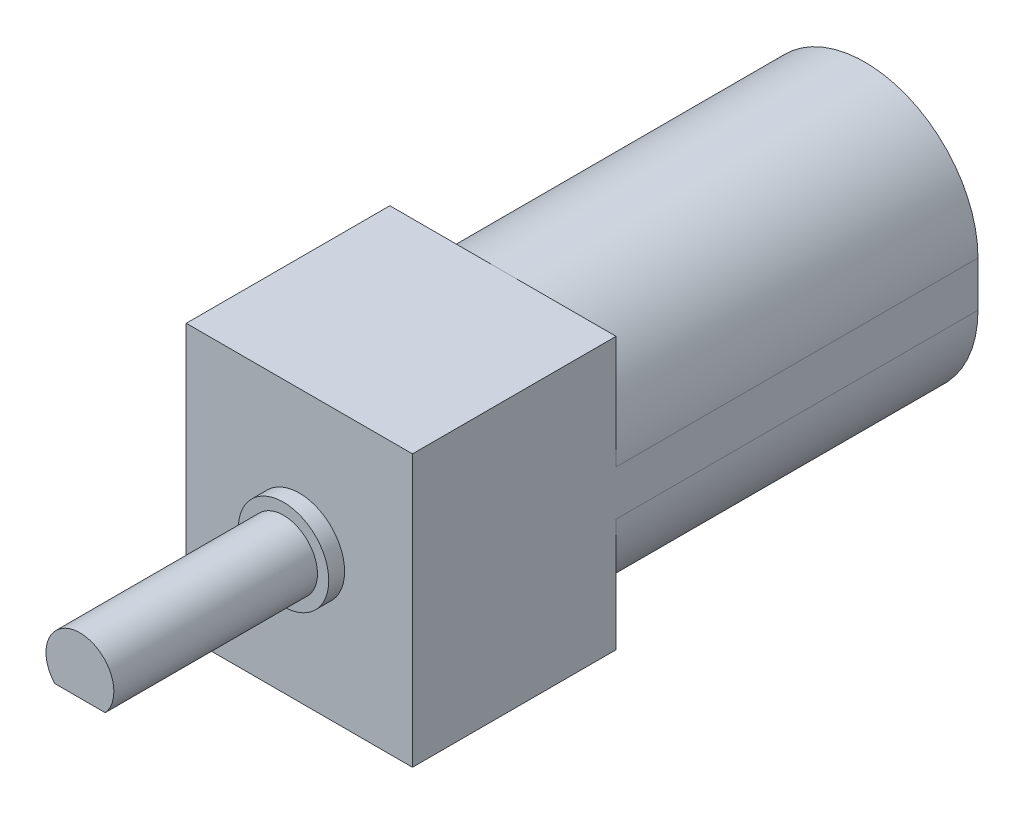
ISO-10303-21;
HEADER;
FILE_DESCRIPTION(('STEP AP214'),'2;1');
FILE_NAME('part.step','',(''),(''),'','','');
FILE_SCHEMA(('AUTOMOTIVE_DESIGN { 1 0 10303 214 1 1 1 1 }'));
ENDSEC;
DATA;
#1=APPLICATION_CONTEXT('core data for automotive mechanical design processes');
#2=APPLICATION_PROTOCOL_DEFINITION('international standard','automotive_design',2000,#1);
#3=PRODUCT_CONTEXT('',#1,'mechanical');
#4=PRODUCT('Part','Part','',(#3));
#5=PRODUCT_RELATED_PRODUCT_CATEGORY('part','',(#4));
#6=PRODUCT_DEFINITION_FORMATION('','',#4);
#7=PRODUCT_DEFINITION_CONTEXT('part definition',#1,'design');
#8=PRODUCT_DEFINITION('design','',#6,#7);
#9=PRODUCT_DEFINITION_SHAPE('','',#8);
#10=(LENGTH_UNIT() NAMED_UNIT(*) SI_UNIT(.MILLI.,.METRE.));
#11=(NAMED_UNIT(*) PLANE_ANGLE_UNIT() SI_UNIT($,.RADIAN.));
#12=(NAMED_UNIT(*) SI_UNIT($,.STERADIAN.) SOLID_ANGLE_UNIT());
#13=UNCERTAINTY_MEASURE_WITH_UNIT(LENGTH_MEASURE(1.E-05),#10,'distance_accuracy_value','');
#14=(GEOMETRIC_REPRESENTATION_CONTEXT(3) GLOBAL_UNCERTAINTY_ASSIGNED_CONTEXT((#13)) GLOBAL_UNIT_ASSIGNED_CONTEXT((#10,
#11,#12)) REPRESENTATION_CONTEXT('',''));
#15=CARTESIAN_POINT('',(0.,0.,0.));
#16=DIRECTION('',(0.,0.,1.));
#17=DIRECTION('',(1.,0.,0.));
#18=AXIS2_PLACEMENT_3D('',#15,#16,#17);
#19=CARTESIAN_POINT('',(0.,-0.999999999999999,16.));
#20=DIRECTION('',(0.,0.,-1.));
#21=DIRECTION('',(-1.,0.,0.));
#22=AXIS2_PLACEMENT_3D('',#19,#20,#21);
#23=CYLINDRICAL_SURFACE('',#22,5.);
#24=CARTESIAN_POINT('',(0.,-0.999999999999999,0.));
#25=DIRECTION('',(0.,0.,1.));
#26=DIRECTION('',(1.,0.,0.));
#27=AXIS2_PLACEMENT_3D('',#24,#25,#26);
#28=CIRCLE('',#27,5.);
#29=CARTESIAN_POINT('',(-5.,-0.999999999999999,0.));
#30=VERTEX_POINT('',#29);
#31=CARTESIAN_POINT('',(5.,-0.999999999999999,0.));
#32=VERTEX_POINT('',#31);
#33=EDGE_CURVE('E265',#30,#32,#28,.T.);
#34=ORIENTED_EDGE('',*,*,#33,.T.);
#35=DIRECTION('',(0.,0.,-1.));
#36=VECTOR('',#35,1.);
#37=CARTESIAN_POINT('',(5.,-0.999999999999999,16.));
#38=LINE('',#37,#36);
#39=CARTESIAN_POINT('',(5.,-0.999999999999999,16.));
#40=VERTEX_POINT('',#39);
#41=EDGE_CURVE('E228',#40,#32,#38,.T.);
#42=ORIENTED_EDGE('',*,*,#41,.F.);
#43=CARTESIAN_POINT('',(0.,-0.999999999999999,16.));
#44=DIRECTION('',(0.,0.,1.));
#45=DIRECTION('',(1.,0.,0.));
#46=AXIS2_PLACEMENT_3D('',#43,#44,#45);
#47=CIRCLE('',#46,5.);
#48=CARTESIAN_POINT('',(0.,-6.,16.));
#49=VERTEX_POINT('',#48);
#50=EDGE_CURVE('E212',#49,#40,#47,.T.);
#51=ORIENTED_EDGE('',*,*,#50,.F.);
#52=CARTESIAN_POINT('',(-5.,-0.999999999999999,16.));
#53=VERTEX_POINT('',#52);
#54=EDGE_CURVE('E216',#53,#49,#47,.T.);
#55=ORIENTED_EDGE('',*,*,#54,.F.);
#56=DIRECTION('',(0.,0.,-1.));
#57=VECTOR('',#56,1.);
#58=CARTESIAN_POINT('',(-5.,-0.999999999999999,16.));
#59=LINE('',#58,#57);
#60=EDGE_CURVE('E237',#53,#30,#59,.T.);
#61=ORIENTED_EDGE('',*,*,#60,.T.);
#62=EDGE_LOOP('',(#34,#42,#51,#55,#61));
#63=FACE_BOUND('',#62,.T.);
#64=ADVANCED_FACE('F39',(#63),#23,.T.);
#65=CARTESIAN_POINT('',(5.,-0.999999999999999,16.));
#66=DIRECTION('',(-1.,0.,0.));
#67=DIRECTION('',(0.,0.,1.));
#68=AXIS2_PLACEMENT_3D('',#65,#66,#67);
#69=PLANE('',#68);
#70=DIRECTION('',(0.,1.,0.));
#71=VECTOR('',#70,1.);
#72=CARTESIAN_POINT('',(5.,-0.999999999999999,0.));
#73=LINE('',#72,#71);
#74=CARTESIAN_POINT('',(5.,0.999999999999999,0.));
#75=VERTEX_POINT('',#74);
#76=EDGE_CURVE('E264',#32,#75,#73,.T.);
#77=ORIENTED_EDGE('',*,*,#76,.T.);
#78=DIRECTION('',(0.,0.,-1.));
#79=VECTOR('',#78,1.);
#80=CARTESIAN_POINT('',(5.,0.999999999999999,16.));
#81=LINE('',#80,#79);
#82=CARTESIAN_POINT('',(5.,0.999999999999999,16.));
#83=VERTEX_POINT('',#82);
#84=EDGE_CURVE('E244',#83,#75,#81,.T.);
#85=ORIENTED_EDGE('',*,*,#84,.F.);
#86=DIRECTION('',(0.,1.,0.));
#87=VECTOR('',#86,1.);
#88=CARTESIAN_POINT('',(5.,-6.,16.));
#89=LINE('',#88,#87);
#90=CARTESIAN_POINT('',(5.,6.,16.));
#91=VERTEX_POINT('',#90);
#92=EDGE_CURVE('E192',#83,#91,#89,.T.);
#93=ORIENTED_EDGE('',*,*,#92,.T.);
#94=DIRECTION('',(0.,0.,-1.));
#95=VECTOR('',#94,1.);
#96=CARTESIAN_POINT('',(5.,6.,25.));
#97=LINE('',#96,#95);
#98=CARTESIAN_POINT('',(5.,6.,25.));
#99=VERTEX_POINT('',#98);
#100=EDGE_CURVE('E181',#99,#91,#97,.T.);
#101=ORIENTED_EDGE('',*,*,#100,.F.);
#102=DIRECTION('',(0.,1.,0.));
#103=VECTOR('',#102,1.);
#104=CARTESIAN_POINT('',(5.,-6.,25.));
#105=LINE('',#104,#103);
#106=CARTESIAN_POINT('',(5.,-6.,25.));
#107=VERTEX_POINT('',#106);
#108=EDGE_CURVE('E156',#107,#99,#105,.T.);
#109=ORIENTED_EDGE('',*,*,#108,.F.);
#110=DIRECTION('',(0.,0.,-1.));
#111=VECTOR('',#110,1.);
#112=CARTESIAN_POINT('',(5.,-6.,25.));
#113=LINE('',#112,#111);
#114=CARTESIAN_POINT('',(5.,-6.,16.));
#115=VERTEX_POINT('',#114);
#116=EDGE_CURVE('E178',#107,#115,#113,.T.);
#117=ORIENTED_EDGE('',*,*,#116,.T.);
#118=EDGE_CURVE('E194',#115,#40,#89,.T.);
#119=ORIENTED_EDGE('',*,*,#118,.T.);
#120=ORIENTED_EDGE('',*,*,#41,.T.);
#121=EDGE_LOOP('',(#77,#85,#93,#101,#109,#117,#119,#120));
#122=FACE_BOUND('',#121,.T.);
#123=ADVANCED_FACE('F210',(#122),#69,.F.);
#124=CARTESIAN_POINT('',(0.,0.999999999999999,16.));
#125=DIRECTION('',(0.,0.,-1.));
#126=DIRECTION('',(-1.,0.,0.));
#127=AXIS2_PLACEMENT_3D('',#124,#125,#126);
#128=CYLINDRICAL_SURFACE('',#127,5.);
#129=CARTESIAN_POINT('',(0.,0.999999999999999,0.));
#130=DIRECTION('',(0.,0.,1.));
#131=DIRECTION('',(1.,0.,0.));
#132=AXIS2_PLACEMENT_3D('',#129,#130,#131);
#133=CIRCLE('',#132,5.);
#134=CARTESIAN_POINT('',(-5.,0.999999999999999,0.));
#135=VERTEX_POINT('',#134);
#136=EDGE_CURVE('E220',#75,#135,#133,.T.);
#137=ORIENTED_EDGE('',*,*,#136,.T.);
#138=DIRECTION('',(0.,0.,-1.));
#139=VECTOR('',#138,1.);
#140=CARTESIAN_POINT('',(-5.,0.999999999999999,16.));
#141=LINE('',#140,#139);
#142=CARTESIAN_POINT('',(-5.,0.999999999999999,16.));
#143=VERTEX_POINT('',#142);
#144=EDGE_CURVE('E239',#143,#135,#141,.T.);
#145=ORIENTED_EDGE('',*,*,#144,.F.);
#146=CARTESIAN_POINT('',(0.,0.999999999999999,16.));
#147=DIRECTION('',(0.,0.,1.));
#148=DIRECTION('',(1.,0.,0.));
#149=AXIS2_PLACEMENT_3D('',#146,#147,#148);
#150=CIRCLE('',#149,5.);
#151=CARTESIAN_POINT('',(0.,6.,16.));
#152=VERTEX_POINT('',#151);
#153=EDGE_CURVE('E61',#152,#143,#150,.T.);
#154=ORIENTED_EDGE('',*,*,#153,.F.);
#155=EDGE_CURVE('E225',#83,#152,#150,.T.);
#156=ORIENTED_EDGE('',*,*,#155,.F.);
#157=ORIENTED_EDGE('',*,*,#84,.T.);
#158=EDGE_LOOP('',(#137,#145,#154,#156,#157));
#159=FACE_BOUND('',#158,.T.);
#160=ADVANCED_FACE('F288',(#159),#128,.T.);
#161=CARTESIAN_POINT('',(-5.,-0.999999999999999,16.));
#162=DIRECTION('',(1.,0.,0.));
#163=DIRECTION('',(0.,0.,-1.));
#164=AXIS2_PLACEMENT_3D('',#161,#162,#163);
#165=PLANE('',#164);
#166=DIRECTION('',(0.,-1.,0.));
#167=VECTOR('',#166,1.);
#168=CARTESIAN_POINT('',(-5.,-0.999999999999999,0.));
#169=LINE('',#168,#167);
#170=EDGE_CURVE('E217',#135,#30,#169,.T.);
#171=ORIENTED_EDGE('',*,*,#170,.T.);
#172=ORIENTED_EDGE('',*,*,#60,.F.);
#173=DIRECTION('',(0.,-1.,0.));
#174=VECTOR('',#173,1.);
#175=CARTESIAN_POINT('',(-5.,-6.,16.));
#176=LINE('',#175,#174);
#177=CARTESIAN_POINT('',(-5.,-6.,16.));
#178=VERTEX_POINT('',#177);
#179=EDGE_CURVE('E148',#53,#178,#176,.T.);
#180=ORIENTED_EDGE('',*,*,#179,.T.);
#181=DIRECTION('',(0.,0.,-1.));
#182=VECTOR('',#181,1.);
#183=CARTESIAN_POINT('',(-5.,-6.,25.));
#184=LINE('',#183,#182);
#185=CARTESIAN_POINT('',(-5.,-6.,25.));
#186=VERTEX_POINT('',#185);
#187=EDGE_CURVE('E174',#186,#178,#184,.T.);
#188=ORIENTED_EDGE('',*,*,#187,.F.);
#189=DIRECTION('',(0.,-1.,0.));
#190=VECTOR('',#189,1.);
#191=CARTESIAN_POINT('',(-5.,-6.,25.));
#192=LINE('',#191,#190);
#193=CARTESIAN_POINT('',(-5.,6.,25.));
#194=VERTEX_POINT('',#193);
#195=EDGE_CURVE('E150',#194,#186,#192,.T.);
#196=ORIENTED_EDGE('',*,*,#195,.F.);
#197=DIRECTION('',(0.,0.,-1.));
#198=VECTOR('',#197,1.);
#199=CARTESIAN_POINT('',(-5.,6.,25.));
#200=LINE('',#199,#198);
#201=CARTESIAN_POINT('',(-5.,6.,16.));
#202=VERTEX_POINT('',#201);
#203=EDGE_CURVE('E161',#194,#202,#200,.T.);
#204=ORIENTED_EDGE('',*,*,#203,.T.);
#205=EDGE_CURVE('E170',#202,#143,#176,.T.);
#206=ORIENTED_EDGE('',*,*,#205,.T.);
#207=ORIENTED_EDGE('',*,*,#144,.T.);
#208=EDGE_LOOP('',(#171,#172,#180,#188,#196,#204,#206,#207));
#209=FACE_BOUND('',#208,.T.);
#210=ADVANCED_FACE('F281',(#209),#165,.F.);
#211=CARTESIAN_POINT('',(0.,-0.999999999999999,0.));
#212=DIRECTION('',(0.,0.,1.));
#213=DIRECTION('',(1.,0.,0.));
#214=AXIS2_PLACEMENT_3D('',#211,#212,#213);
#215=PLANE('',#214);
#216=CARTESIAN_POINT('',(0.,0.,0.));
#217=DIRECTION('',(0.,0.,1.));
#218=DIRECTION('',(1.,0.,0.));
#219=AXIS2_PLACEMENT_3D('',#216,#217,#218);
#220=CIRCLE('',#219,2.5);
#221=CARTESIAN_POINT('',(2.5,0.,0.));
#222=VERTEX_POINT('',#221);
#223=EDGE_CURVE('E127',#222,#222,#220,.F.);
#224=ORIENTED_EDGE('',*,*,#223,.F.);
#225=EDGE_LOOP('',(#224));
#226=FACE_BOUND('',#225,.T.);
#227=ORIENTED_EDGE('',*,*,#33,.F.);
#228=ORIENTED_EDGE('',*,*,#170,.F.);
#229=ORIENTED_EDGE('',*,*,#136,.F.);
#230=ORIENTED_EDGE('',*,*,#76,.F.);
#231=EDGE_LOOP('',(#227,#228,#229,#230));
#232=FACE_BOUND('',#231,.T.);
#233=ADVANCED_FACE('F273',(#226,#232),#215,.F.);
#234=CARTESIAN_POINT('',(0.,0.,-1.3));
#235=DIRECTION('',(0.,0.,1.));
#236=DIRECTION('',(1.,0.,0.));
#237=AXIS2_PLACEMENT_3D('',#234,#235,#236);
#238=CYLINDRICAL_SURFACE('',#237,2.5);
#239=CARTESIAN_POINT('',(0.,0.,-1.3));
#240=DIRECTION('',(0.,0.,-1.));
#241=DIRECTION('',(-1.,0.,0.));
#242=AXIS2_PLACEMENT_3D('',#239,#240,#241);
#243=CIRCLE('',#242,2.5);
#244=CARTESIAN_POINT('',(-2.5,0.,-1.3));
#245=VERTEX_POINT('',#244);
#246=EDGE_CURVE('E177',#245,#245,#243,.T.);
#247=ORIENTED_EDGE('',*,*,#246,.F.);
#248=EDGE_LOOP('',(#247));
#249=FACE_BOUND('',#248,.T.);
#250=ORIENTED_EDGE('',*,*,#223,.T.);
#251=EDGE_LOOP('',(#250));
#252=FACE_BOUND('',#251,.T.);
#253=ADVANCED_FACE('F271',(#249,#252),#238,.T.);
#254=CARTESIAN_POINT('',(0.,0.,-1.3));
#255=DIRECTION('',(0.,0.,-1.));
#256=DIRECTION('',(-1.,0.,0.));
#257=AXIS2_PLACEMENT_3D('',#254,#255,#256);
#258=PLANE('',#257);
#259=ORIENTED_EDGE('',*,*,#246,.T.);
#260=EDGE_LOOP('',(#259));
#261=FACE_BOUND('',#260,.T.);
#262=ADVANCED_FACE('F269',(#261),#258,.T.);
#263=CARTESIAN_POINT('',(0.,0.,16.));
#264=DIRECTION('',(0.,0.,1.));
#265=DIRECTION('',(1.,0.,0.));
#266=AXIS2_PLACEMENT_3D('',#263,#264,#265);
#267=PLANE('',#266);
#268=ORIENTED_EDGE('',*,*,#179,.F.);
#269=ORIENTED_EDGE('',*,*,#54,.T.);
#270=DIRECTION('',(1.,0.,0.));
#271=VECTOR('',#270,1.);
#272=CARTESIAN_POINT('',(5.,-6.,16.));
#273=LINE('',#272,#271);
#274=EDGE_CURVE('E164',#178,#49,#273,.T.);
#275=ORIENTED_EDGE('',*,*,#274,.F.);
#276=EDGE_LOOP('',(#268,#269,#275));
#277=FACE_BOUND('',#276,.T.);
#278=ADVANCED_FACE('F279',(#277),#267,.F.);
#279=EDGE_CURVE('E173',#49,#115,#273,.T.);
#280=ORIENTED_EDGE('',*,*,#279,.F.);
#281=ORIENTED_EDGE('',*,*,#50,.T.);
#282=ORIENTED_EDGE('',*,*,#118,.F.);
#283=EDGE_LOOP('',(#280,#281,#282));
#284=FACE_BOUND('',#283,.T.);
#285=ADVANCED_FACE('F211',(#284),#267,.F.);
#286=ORIENTED_EDGE('',*,*,#92,.F.);
#287=ORIENTED_EDGE('',*,*,#155,.T.);
#288=DIRECTION('',(-1.,0.,0.));
#289=VECTOR('',#288,1.);
#290=CARTESIAN_POINT('',(5.,6.,16.));
#291=LINE('',#290,#289);
#292=EDGE_CURVE('E154',#91,#152,#291,.T.);
#293=ORIENTED_EDGE('',*,*,#292,.F.);
#294=EDGE_LOOP('',(#286,#287,#293));
#295=FACE_BOUND('',#294,.T.);
#296=ADVANCED_FACE('F300',(#295),#267,.F.);
#297=EDGE_CURVE('E188',#152,#202,#291,.T.);
#298=ORIENTED_EDGE('',*,*,#297,.F.);
#299=ORIENTED_EDGE('',*,*,#153,.T.);
#300=ORIENTED_EDGE('',*,*,#205,.F.);
#301=EDGE_LOOP('',(#298,#299,#300));
#302=FACE_BOUND('',#301,.T.);
#303=ADVANCED_FACE('F313',(#302),#267,.F.);
#304=CARTESIAN_POINT('',(5.,-6.,25.));
#305=DIRECTION('',(0.,1.,0.));
#306=DIRECTION('',(0.,0.,1.));
#307=AXIS2_PLACEMENT_3D('',#304,#305,#306);
#308=PLANE('',#307);
#309=ORIENTED_EDGE('',*,*,#274,.T.);
#310=ORIENTED_EDGE('',*,*,#279,.T.);
#311=ORIENTED_EDGE('',*,*,#116,.F.);
#312=DIRECTION('',(1.,0.,0.));
#313=VECTOR('',#312,1.);
#314=CARTESIAN_POINT('',(5.,-6.,25.));
#315=LINE('',#314,#313);
#316=EDGE_CURVE('E153',#186,#107,#315,.T.);
#317=ORIENTED_EDGE('',*,*,#316,.F.);
#318=ORIENTED_EDGE('',*,*,#187,.T.);
#319=EDGE_LOOP('',(#309,#310,#311,#317,#318));
#320=FACE_BOUND('',#319,.T.);
#321=ADVANCED_FACE('F206',(#320),#308,.F.);
#322=CARTESIAN_POINT('',(5.,6.,25.));
#323=DIRECTION('',(0.,-1.,0.));
#324=DIRECTION('',(0.,0.,-1.));
#325=AXIS2_PLACEMENT_3D('',#322,#323,#324);
#326=PLANE('',#325);
#327=ORIENTED_EDGE('',*,*,#292,.T.);
#328=ORIENTED_EDGE('',*,*,#297,.T.);
#329=ORIENTED_EDGE('',*,*,#203,.F.);
#330=DIRECTION('',(-1.,0.,0.));
#331=VECTOR('',#330,1.);
#332=CARTESIAN_POINT('',(5.,6.,25.));
#333=LINE('',#332,#331);
#334=EDGE_CURVE('E159',#99,#194,#333,.T.);
#335=ORIENTED_EDGE('',*,*,#334,.F.);
#336=ORIENTED_EDGE('',*,*,#100,.T.);
#337=EDGE_LOOP('',(#327,#328,#329,#335,#336));
#338=FACE_BOUND('',#337,.T.);
#339=ADVANCED_FACE('F302',(#338),#326,.F.);
#340=CARTESIAN_POINT('',(0.,0.,25.));
#341=DIRECTION('',(0.,0.,1.));
#342=DIRECTION('',(1.,0.,0.));
#343=AXIS2_PLACEMENT_3D('',#340,#341,#342);
#344=PLANE('',#343);
#345=CARTESIAN_POINT('',(0.,0.,25.));
#346=DIRECTION('',(0.,0.,1.));
#347=DIRECTION('',(1.,0.,0.));
#348=AXIS2_PLACEMENT_3D('',#345,#346,#347);
#349=CIRCLE('',#348,2.);
#350=CARTESIAN_POINT('',(2.,0.,25.));
#351=VERTEX_POINT('',#350);
#352=EDGE_CURVE('E136',#351,#351,#349,.T.);
#353=ORIENTED_EDGE('',*,*,#352,.F.);
#354=EDGE_LOOP('',(#353));
#355=FACE_BOUND('',#354,.T.);
#356=ORIENTED_EDGE('',*,*,#195,.T.);
#357=ORIENTED_EDGE('',*,*,#316,.T.);
#358=ORIENTED_EDGE('',*,*,#108,.T.);
#359=ORIENTED_EDGE('',*,*,#334,.T.);
#360=EDGE_LOOP('',(#356,#357,#358,#359));
#361=FACE_BOUND('',#360,.T.);
#362=ADVANCED_FACE('F307',(#355,#361),#344,.T.);
#363=CARTESIAN_POINT('',(0.,0.,25.7));
#364=DIRECTION('',(0.,0.,-1.));
#365=DIRECTION('',(-1.,0.,0.));
#366=AXIS2_PLACEMENT_3D('',#363,#364,#365);
#367=CYLINDRICAL_SURFACE('',#366,2.);
#368=CARTESIAN_POINT('',(0.,0.,25.7));
#369=DIRECTION('',(0.,0.,1.));
#370=DIRECTION('',(1.,0.,0.));
#371=AXIS2_PLACEMENT_3D('',#368,#369,#370);
#372=CIRCLE('',#371,2.);
#373=CARTESIAN_POINT('',(2.,0.,25.7));
#374=VERTEX_POINT('',#373);
#375=EDGE_CURVE('E140',#374,#374,#372,.T.);
#376=ORIENTED_EDGE('',*,*,#375,.F.);
#377=EDGE_LOOP('',(#376));
#378=FACE_BOUND('',#377,.T.);
#379=ORIENTED_EDGE('',*,*,#352,.T.);
#380=EDGE_LOOP('',(#379));
#381=FACE_BOUND('',#380,.T.);
#382=ADVANCED_FACE('F384',(#378,#381),#367,.T.);
#383=CARTESIAN_POINT('',(0.,0.,25.7));
#384=DIRECTION('',(0.,0.,1.));
#385=DIRECTION('',(1.,0.,0.));
#386=AXIS2_PLACEMENT_3D('',#383,#384,#385);
#387=PLANE('',#386);
#388=CARTESIAN_POINT('',(0.,0.,25.7));
#389=DIRECTION('',(0.,0.,1.));
#390=DIRECTION('',(1.,0.,0.));
#391=AXIS2_PLACEMENT_3D('',#388,#389,#390);
#392=CIRCLE('',#391,1.5);
#393=CARTESIAN_POINT('',(1.5,0.,25.7));
#394=VERTEX_POINT('',#393);
#395=EDGE_CURVE('E137',#394,#394,#392,.T.);
#396=ORIENTED_EDGE('',*,*,#395,.F.);
#397=EDGE_LOOP('',(#396));
#398=FACE_BOUND('',#397,.T.);
#399=ORIENTED_EDGE('',*,*,#375,.T.);
#400=EDGE_LOOP('',(#399));
#401=FACE_BOUND('',#400,.T.);
#402=ADVANCED_FACE('F405',(#398,#401),#387,.T.);
#403=CARTESIAN_POINT('',(0.,0.,34.7));
#404=DIRECTION('',(0.,0.,-1.));
#405=DIRECTION('',(-1.,0.,0.));
#406=AXIS2_PLACEMENT_3D('',#403,#404,#405);
#407=CYLINDRICAL_SURFACE('',#406,1.5);
#408=CARTESIAN_POINT('',(0.,0.,34.7));
#409=DIRECTION('',(0.,0.,1.));
#410=DIRECTION('',(1.,0.,0.));
#411=AXIS2_PLACEMENT_3D('',#408,#409,#410);
#412=CIRCLE('',#411,1.5);
#413=CARTESIAN_POINT('',(1.1180339887499,-1.,34.7));
#414=VERTEX_POINT('',#413);
#415=CARTESIAN_POINT('',(-1.1180339887499,-1.,34.7));
#416=VERTEX_POINT('',#415);
#417=EDGE_CURVE('E131',#414,#416,#412,.T.);
#418=ORIENTED_EDGE('',*,*,#417,.F.);
#419=DIRECTION('',(0.,0.,-1.));
#420=VECTOR('',#419,1.);
#421=CARTESIAN_POINT('',(1.1180339887499,-1.,34.7));
#422=LINE('',#421,#420);
#423=CARTESIAN_POINT('',(1.1180339887499,-1.,25.8));
#424=VERTEX_POINT('',#423);
#425=EDGE_CURVE('E53',#414,#424,#422,.T.);
#426=ORIENTED_EDGE('',*,*,#425,.T.);
#427=CARTESIAN_POINT('',(0.,0.,25.8));
#428=DIRECTION('',(0.,0.,-1.));
#429=DIRECTION('',(-1.,0.,0.));
#430=AXIS2_PLACEMENT_3D('',#427,#428,#429);
#431=CIRCLE('',#430,1.5);
#432=CARTESIAN_POINT('',(-1.1180339887499,-1.,25.8));
#433=VERTEX_POINT('',#432);
#434=EDGE_CURVE('E11',#424,#433,#431,.T.);
#435=ORIENTED_EDGE('',*,*,#434,.T.);
#436=DIRECTION('',(0.,0.,-1.));
#437=VECTOR('',#436,1.);
#438=CARTESIAN_POINT('',(-1.1180339887499,-1.,34.7));
#439=LINE('',#438,#437);
#440=EDGE_CURVE('E122',#433,#416,#439,.F.);
#441=ORIENTED_EDGE('',*,*,#440,.T.);
#442=EDGE_LOOP('',(#418,#426,#435,#441));
#443=FACE_BOUND('',#442,.T.);
#444=ORIENTED_EDGE('',*,*,#395,.T.);
#445=EDGE_LOOP('',(#444));
#446=FACE_BOUND('',#445,.T.);
#447=ADVANCED_FACE('F129',(#443,#446),#407,.T.);
#448=CARTESIAN_POINT('',(0.,0.,34.7));
#449=DIRECTION('',(0.,0.,1.));
#450=DIRECTION('',(1.,0.,0.));
#451=AXIS2_PLACEMENT_3D('',#448,#449,#450);
#452=PLANE('',#451);
#453=DIRECTION('',(-1.,0.,0.));
#454=VECTOR('',#453,1.);
#455=CARTESIAN_POINT('',(0.,-1.,34.7));
#456=LINE('',#455,#454);
#457=EDGE_CURVE('E46',#414,#416,#456,.T.);
#458=ORIENTED_EDGE('',*,*,#457,.F.);
#459=ORIENTED_EDGE('',*,*,#417,.T.);
#460=EDGE_LOOP('',(#458,#459));
#461=FACE_BOUND('',#460,.T.);
#462=ADVANCED_FACE('F135',(#461),#452,.T.);
#463=CARTESIAN_POINT('',(0.,0.,25.8));
#464=DIRECTION('',(0.,0.,-1.));
#465=DIRECTION('',(-1.,0.,0.));
#466=AXIS2_PLACEMENT_3D('',#463,#464,#465);
#467=PLANE('',#466);
#468=DIRECTION('',(-1.,0.,0.));
#469=VECTOR('',#468,1.);
#470=CARTESIAN_POINT('',(2.67427476758811,-1.,25.8));
#471=LINE('',#470,#469);
#472=EDGE_CURVE('E133',#424,#433,#471,.T.);
#473=ORIENTED_EDGE('',*,*,#472,.T.);
#474=ORIENTED_EDGE('',*,*,#434,.F.);
#475=EDGE_LOOP('',(#473,#474));
#476=FACE_BOUND('',#475,.T.);
#477=ADVANCED_FACE('F396',(#476),#467,.F.);
#478=CARTESIAN_POINT('',(2.67427476758811,-1.,25.8));
#479=DIRECTION('',(0.,1.,0.));
#480=DIRECTION('',(-1.,0.,0.));
#481=AXIS2_PLACEMENT_3D('',#478,#479,#480);
#482=PLANE('',#481);
#483=ORIENTED_EDGE('',*,*,#457,.T.);
#484=ORIENTED_EDGE('',*,*,#440,.F.);
#485=ORIENTED_EDGE('',*,*,#472,.F.);
#486=ORIENTED_EDGE('',*,*,#425,.F.);
#487=EDGE_LOOP('',(#483,#484,#485,#486));
#488=FACE_BOUND('',#487,.T.);
#489=ADVANCED_FACE('F121',(#488),#482,.F.);
#490=CLOSED_SHELL('',(#64,#123,#160,#210,#233,#253,#262,#278,#285,#296,#303,#321,#339,#362,#382,
#402,#447,#462,#477,#489));
#491=MANIFOLD_SOLID_BREP('B2',#490);
#492=ADVANCED_BREP_SHAPE_REPRESENTATION('',(#18,#491),#14);
#493=SHAPE_DEFINITION_REPRESENTATION(#9,#492);
ENDSEC;
END-ISO-10303-21;
